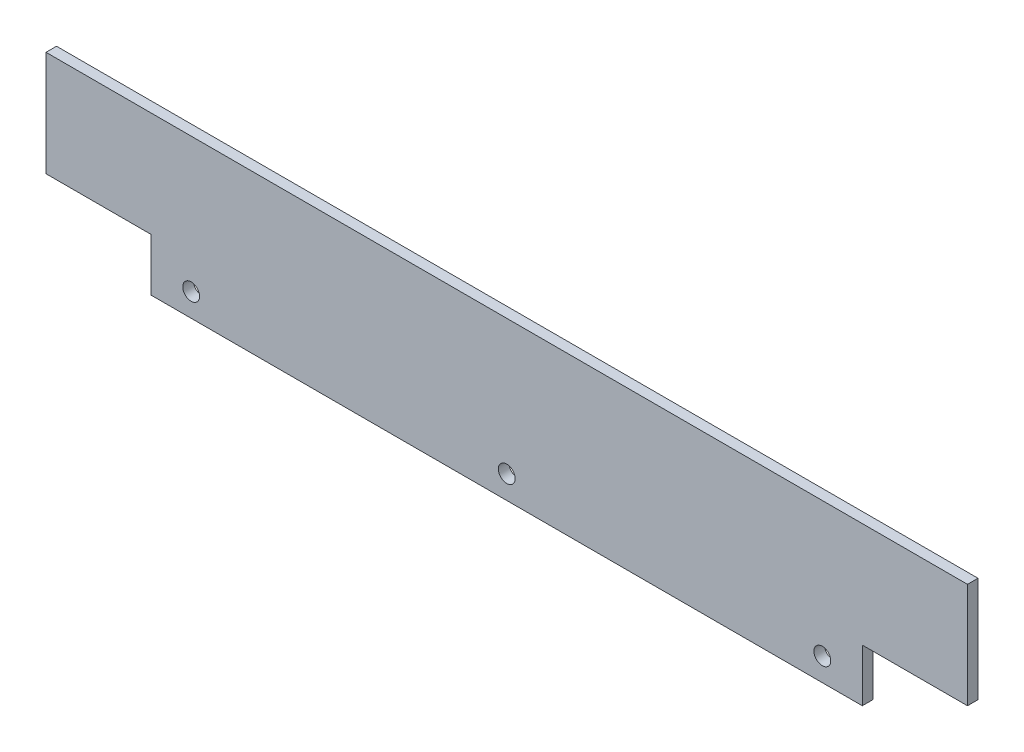
ISO-10303-21;
HEADER;
FILE_DESCRIPTION(('STEP AP214'),'2;1');
FILE_NAME('part.step','',(''),(''),'','','');
FILE_SCHEMA(('AUTOMOTIVE_DESIGN { 1 0 10303 214 1 1 1 1 }'));
ENDSEC;
DATA;
#1=APPLICATION_CONTEXT('core data for automotive mechanical design processes');
#2=APPLICATION_PROTOCOL_DEFINITION('international standard','automotive_design',2000,#1);
#3=PRODUCT_CONTEXT('',#1,'mechanical');
#4=PRODUCT('Part','Part','',(#3));
#5=PRODUCT_RELATED_PRODUCT_CATEGORY('part','',(#4));
#6=PRODUCT_DEFINITION_FORMATION('','',#4);
#7=PRODUCT_DEFINITION_CONTEXT('part definition',#1,'design');
#8=PRODUCT_DEFINITION('design','',#6,#7);
#9=PRODUCT_DEFINITION_SHAPE('','',#8);
#10=(LENGTH_UNIT() NAMED_UNIT(*) SI_UNIT(.MILLI.,.METRE.));
#11=(NAMED_UNIT(*) PLANE_ANGLE_UNIT() SI_UNIT($,.RADIAN.));
#12=(NAMED_UNIT(*) SI_UNIT($,.STERADIAN.) SOLID_ANGLE_UNIT());
#13=UNCERTAINTY_MEASURE_WITH_UNIT(LENGTH_MEASURE(1.E-05),#10,'distance_accuracy_value','');
#14=(GEOMETRIC_REPRESENTATION_CONTEXT(3) GLOBAL_UNCERTAINTY_ASSIGNED_CONTEXT((#13)) GLOBAL_UNIT_ASSIGNED_CONTEXT((#10,
#11,#12)) REPRESENTATION_CONTEXT('',''));
#15=CARTESIAN_POINT('',(0.,0.,0.));
#16=DIRECTION('',(0.,0.,1.));
#17=DIRECTION('',(1.,0.,0.));
#18=AXIS2_PLACEMENT_3D('',#15,#16,#17);
#19=CARTESIAN_POINT('',(0.,0.,4.99999999999995));
#20=DIRECTION('',(0.,0.,-1.));
#21=DIRECTION('',(-1.,0.,0.));
#22=AXIS2_PLACEMENT_3D('',#19,#20,#21);
#23=PLANE('',#22);
#24=DIRECTION('',(0.,1.,0.));
#25=VECTOR('',#24,1.);
#26=CARTESIAN_POINT('',(0.,25.,4.99999999999978));
#27=LINE('',#26,#25);
#28=CARTESIAN_POINT('',(0.,0.,4.99999999999995));
#29=VERTEX_POINT('',#28);
#30=CARTESIAN_POINT('',(0.,25.,4.99999999999978));
#31=VERTEX_POINT('',#30);
#32=EDGE_CURVE('E148',#29,#31,#27,.T.);
#33=ORIENTED_EDGE('',*,*,#32,.T.);
#34=DIRECTION('',(1.,0.,0.));
#35=VECTOR('',#34,1.);
#36=CARTESIAN_POINT('',(50.,25.,5.));
#37=LINE('',#36,#35);
#38=CARTESIAN_POINT('',(50.,25.,5.));
#39=VERTEX_POINT('',#38);
#40=EDGE_CURVE('E96',#31,#39,#37,.T.);
#41=ORIENTED_EDGE('',*,*,#40,.T.);
#42=DIRECTION('',(0.,1.,0.));
#43=VECTOR('',#42,1.);
#44=CARTESIAN_POINT('',(50.,75.,5.));
#45=LINE('',#44,#43);
#46=CARTESIAN_POINT('',(50.,75.,5.));
#47=VERTEX_POINT('',#46);
#48=EDGE_CURVE('E163',#39,#47,#45,.T.);
#49=ORIENTED_EDGE('',*,*,#48,.T.);
#50=DIRECTION('',(-1.,0.,0.));
#51=VECTOR('',#50,1.);
#52=CARTESIAN_POINT('',(-388.,75.,4.99999999999987));
#53=LINE('',#52,#51);
#54=CARTESIAN_POINT('',(-388.,75.,4.99999999999987));
#55=VERTEX_POINT('',#54);
#56=EDGE_CURVE('E176',#47,#55,#53,.T.);
#57=ORIENTED_EDGE('',*,*,#56,.T.);
#58=DIRECTION('',(0.,-1.,0.));
#59=VECTOR('',#58,1.);
#60=CARTESIAN_POINT('',(-388.,24.9999999999999,4.99999999999987));
#61=LINE('',#60,#59);
#62=CARTESIAN_POINT('',(-388.,24.9999999999999,4.99999999999987));
#63=VERTEX_POINT('',#62);
#64=EDGE_CURVE('E115',#55,#63,#61,.T.);
#65=ORIENTED_EDGE('',*,*,#64,.T.);
#66=DIRECTION('',(1.,0.,0.));
#67=VECTOR('',#66,1.);
#68=CARTESIAN_POINT('',(-338.,25.,4.9999999999997));
#69=LINE('',#68,#67);
#70=CARTESIAN_POINT('',(-338.,25.,4.9999999999997));
#71=VERTEX_POINT('',#70);
#72=EDGE_CURVE('E109',#63,#71,#69,.T.);
#73=ORIENTED_EDGE('',*,*,#72,.T.);
#74=DIRECTION('',(0.,-1.,0.));
#75=VECTOR('',#74,1.);
#76=CARTESIAN_POINT('',(-338.,0.,4.99999999999978));
#77=LINE('',#76,#75);
#78=CARTESIAN_POINT('',(-338.,0.,4.99999999999978));
#79=VERTEX_POINT('',#78);
#80=EDGE_CURVE('E113',#71,#79,#77,.T.);
#81=ORIENTED_EDGE('',*,*,#80,.T.);
#82=DIRECTION('',(1.,0.,0.));
#83=VECTOR('',#82,1.);
#84=CARTESIAN_POINT('',(0.,0.,4.99999999999995));
#85=LINE('',#84,#83);
#86=EDGE_CURVE('E53',#79,#29,#85,.T.);
#87=ORIENTED_EDGE('',*,*,#86,.T.);
#88=EDGE_LOOP('',(#33,#41,#49,#57,#65,#73,#81,#87));
#89=FACE_BOUND('',#88,.T.);
#90=CARTESIAN_POINT('',(-169.,11.,5.));
#91=DIRECTION('',(0.,0.,1.));
#92=DIRECTION('',(1.,0.,0.));
#93=AXIS2_PLACEMENT_3D('',#90,#91,#92);
#94=CIRCLE('',#93,3.99999999999999);
#95=CARTESIAN_POINT('',(-165.,11.,5.));
#96=VERTEX_POINT('',#95);
#97=EDGE_CURVE('E137',#96,#96,#94,.T.);
#98=ORIENTED_EDGE('',*,*,#97,.F.);
#99=EDGE_LOOP('',(#98));
#100=FACE_BOUND('',#99,.T.);
#101=CARTESIAN_POINT('',(-319.,11.,5.));
#102=DIRECTION('',(0.,0.,1.));
#103=DIRECTION('',(1.,0.,0.));
#104=AXIS2_PLACEMENT_3D('',#101,#102,#103);
#105=CIRCLE('',#104,3.99999999999999);
#106=CARTESIAN_POINT('',(-315.,11.,5.));
#107=VERTEX_POINT('',#106);
#108=EDGE_CURVE('E185',#107,#107,#105,.T.);
#109=ORIENTED_EDGE('',*,*,#108,.F.);
#110=EDGE_LOOP('',(#109));
#111=FACE_BOUND('',#110,.T.);
#112=CARTESIAN_POINT('',(-19.0000000000003,11.,5.));
#113=DIRECTION('',(0.,0.,1.));
#114=DIRECTION('',(1.,0.,0.));
#115=AXIS2_PLACEMENT_3D('',#112,#113,#114);
#116=CIRCLE('',#115,4.);
#117=CARTESIAN_POINT('',(-15.0000000000003,11.,5.));
#118=VERTEX_POINT('',#117);
#119=EDGE_CURVE('E191',#118,#118,#116,.T.);
#120=ORIENTED_EDGE('',*,*,#119,.F.);
#121=EDGE_LOOP('',(#120));
#122=FACE_BOUND('',#121,.T.);
#123=ADVANCED_FACE('F36',(#89,#100,#111,#122),#23,.F.);
#124=CARTESIAN_POINT('',(0.,0.,0.));
#125=DIRECTION('',(0.,0.,-1.));
#126=DIRECTION('',(-1.,0.,0.));
#127=AXIS2_PLACEMENT_3D('',#124,#125,#126);
#128=PLANE('',#127);
#129=CARTESIAN_POINT('',(-319.,11.,-1.11022302462516E-13));
#130=DIRECTION('',(0.,0.,1.));
#131=DIRECTION('',(1.,0.,0.));
#132=AXIS2_PLACEMENT_3D('',#129,#130,#131);
#133=CIRCLE('',#132,3.99999999999999);
#134=CARTESIAN_POINT('',(-315.,11.,-1.11022302462516E-13));
#135=VERTEX_POINT('',#134);
#136=EDGE_CURVE('E188',#135,#135,#133,.T.);
#137=ORIENTED_EDGE('',*,*,#136,.T.);
#138=EDGE_LOOP('',(#137));
#139=FACE_BOUND('',#138,.T.);
#140=DIRECTION('',(0.,1.,0.));
#141=VECTOR('',#140,1.);
#142=CARTESIAN_POINT('',(0.,25.,0.));
#143=LINE('',#142,#141);
#144=CARTESIAN_POINT('',(0.,0.,0.));
#145=VERTEX_POINT('',#144);
#146=CARTESIAN_POINT('',(0.,25.,0.));
#147=VERTEX_POINT('',#146);
#148=EDGE_CURVE('E133',#145,#147,#143,.T.);
#149=ORIENTED_EDGE('',*,*,#148,.F.);
#150=DIRECTION('',(1.,0.,0.));
#151=VECTOR('',#150,1.);
#152=CARTESIAN_POINT('',(0.,0.,0.));
#153=LINE('',#152,#151);
#154=CARTESIAN_POINT('',(-338.,0.,0.));
#155=VERTEX_POINT('',#154);
#156=EDGE_CURVE('E88',#155,#145,#153,.T.);
#157=ORIENTED_EDGE('',*,*,#156,.F.);
#158=DIRECTION('',(0.,-1.,0.));
#159=VECTOR('',#158,1.);
#160=CARTESIAN_POINT('',(-338.,0.,0.));
#161=LINE('',#160,#159);
#162=CARTESIAN_POINT('',(-338.,25.,0.));
#163=VERTEX_POINT('',#162);
#164=EDGE_CURVE('E82',#163,#155,#161,.T.);
#165=ORIENTED_EDGE('',*,*,#164,.F.);
#166=DIRECTION('',(1.,0.,0.));
#167=VECTOR('',#166,1.);
#168=CARTESIAN_POINT('',(-338.,25.,0.));
#169=LINE('',#168,#167);
#170=CARTESIAN_POINT('',(-388.,24.9999999999999,-1.94289029309402E-13));
#171=VERTEX_POINT('',#170);
#172=EDGE_CURVE('E123',#171,#163,#169,.T.);
#173=ORIENTED_EDGE('',*,*,#172,.F.);
#174=DIRECTION('',(0.,-1.,0.));
#175=VECTOR('',#174,1.);
#176=CARTESIAN_POINT('',(-388.,24.9999999999999,-1.94289029309402E-13));
#177=LINE('',#176,#175);
#178=CARTESIAN_POINT('',(-388.,75.,-1.94289029309402E-13));
#179=VERTEX_POINT('',#178);
#180=EDGE_CURVE('E143',#179,#171,#177,.T.);
#181=ORIENTED_EDGE('',*,*,#180,.F.);
#182=DIRECTION('',(-1.,0.,0.));
#183=VECTOR('',#182,1.);
#184=CARTESIAN_POINT('',(-388.,75.,-1.94289029309402E-13));
#185=LINE('',#184,#183);
#186=CARTESIAN_POINT('',(50.,75.,-1.11022302462516E-13));
#187=VERTEX_POINT('',#186);
#188=EDGE_CURVE('E141',#187,#179,#185,.T.);
#189=ORIENTED_EDGE('',*,*,#188,.F.);
#190=DIRECTION('',(0.,1.,0.));
#191=VECTOR('',#190,1.);
#192=CARTESIAN_POINT('',(50.,75.,-1.11022302462516E-13));
#193=LINE('',#192,#191);
#194=CARTESIAN_POINT('',(50.,25.,0.));
#195=VERTEX_POINT('',#194);
#196=EDGE_CURVE('E139',#195,#187,#193,.T.);
#197=ORIENTED_EDGE('',*,*,#196,.F.);
#198=DIRECTION('',(1.,0.,0.));
#199=VECTOR('',#198,1.);
#200=CARTESIAN_POINT('',(50.,25.,0.));
#201=LINE('',#200,#199);
#202=EDGE_CURVE('E136',#147,#195,#201,.T.);
#203=ORIENTED_EDGE('',*,*,#202,.F.);
#204=EDGE_LOOP('',(#149,#157,#165,#173,#181,#189,#197,#203));
#205=FACE_BOUND('',#204,.T.);
#206=CARTESIAN_POINT('',(-169.,11.,-1.11022302462516E-13));
#207=DIRECTION('',(0.,0.,1.));
#208=DIRECTION('',(1.,0.,0.));
#209=AXIS2_PLACEMENT_3D('',#206,#207,#208);
#210=CIRCLE('',#209,3.99999999999999);
#211=CARTESIAN_POINT('',(-165.,11.,-1.11022302462516E-13));
#212=VERTEX_POINT('',#211);
#213=EDGE_CURVE('E182',#212,#212,#210,.T.);
#214=ORIENTED_EDGE('',*,*,#213,.T.);
#215=EDGE_LOOP('',(#214));
#216=FACE_BOUND('',#215,.T.);
#217=CARTESIAN_POINT('',(-19.0000000000003,11.,-1.11022302462516E-13));
#218=DIRECTION('',(0.,0.,1.));
#219=DIRECTION('',(1.,0.,0.));
#220=AXIS2_PLACEMENT_3D('',#217,#218,#219);
#221=CIRCLE('',#220,4.);
#222=CARTESIAN_POINT('',(-15.0000000000003,11.,-1.11022302462516E-13));
#223=VERTEX_POINT('',#222);
#224=EDGE_CURVE('E194',#223,#223,#221,.T.);
#225=ORIENTED_EDGE('',*,*,#224,.T.);
#226=EDGE_LOOP('',(#225));
#227=FACE_BOUND('',#226,.T.);
#228=ADVANCED_FACE('F167',(#139,#205,#216,#227),#128,.T.);
#229=CARTESIAN_POINT('',(0.,25.,4.99999999999978));
#230=DIRECTION('',(-1.,0.,0.));
#231=DIRECTION('',(0.,-1.,0.));
#232=AXIS2_PLACEMENT_3D('',#229,#230,#231);
#233=PLANE('',#232);
#234=ORIENTED_EDGE('',*,*,#148,.T.);
#235=DIRECTION('',(0.,0.,-1.));
#236=VECTOR('',#235,1.);
#237=CARTESIAN_POINT('',(0.,25.,4.99999999999978));
#238=LINE('',#237,#236);
#239=EDGE_CURVE('E11',#31,#147,#238,.T.);
#240=ORIENTED_EDGE('',*,*,#239,.F.);
#241=ORIENTED_EDGE('',*,*,#32,.F.);
#242=DIRECTION('',(0.,0.,-1.));
#243=VECTOR('',#242,1.);
#244=CARTESIAN_POINT('',(0.,0.,4.99999999999995));
#245=LINE('',#244,#243);
#246=EDGE_CURVE('E129',#29,#145,#245,.T.);
#247=ORIENTED_EDGE('',*,*,#246,.T.);
#248=EDGE_LOOP('',(#234,#240,#241,#247));
#249=FACE_BOUND('',#248,.T.);
#250=ADVANCED_FACE('F38',(#249),#233,.F.);
#251=CARTESIAN_POINT('',(50.,25.,5.));
#252=DIRECTION('',(0.,1.,0.));
#253=DIRECTION('',(-1.,0.,0.));
#254=AXIS2_PLACEMENT_3D('',#251,#252,#253);
#255=PLANE('',#254);
#256=ORIENTED_EDGE('',*,*,#202,.T.);
#257=DIRECTION('',(0.,0.,-1.));
#258=VECTOR('',#257,1.);
#259=CARTESIAN_POINT('',(50.,25.,5.));
#260=LINE('',#259,#258);
#261=EDGE_CURVE('E45',#39,#195,#260,.T.);
#262=ORIENTED_EDGE('',*,*,#261,.F.);
#263=ORIENTED_EDGE('',*,*,#40,.F.);
#264=ORIENTED_EDGE('',*,*,#239,.T.);
#265=EDGE_LOOP('',(#256,#262,#263,#264));
#266=FACE_BOUND('',#265,.T.);
#267=ADVANCED_FACE('F226',(#266),#255,.F.);
#268=CARTESIAN_POINT('',(50.,75.,5.));
#269=DIRECTION('',(-1.,0.,0.));
#270=DIRECTION('',(0.,-1.,0.));
#271=AXIS2_PLACEMENT_3D('',#268,#269,#270);
#272=PLANE('',#271);
#273=ORIENTED_EDGE('',*,*,#196,.T.);
#274=DIRECTION('',(0.,0.,-1.));
#275=VECTOR('',#274,1.);
#276=CARTESIAN_POINT('',(50.,75.,5.));
#277=LINE('',#276,#275);
#278=EDGE_CURVE('E155',#47,#187,#277,.T.);
#279=ORIENTED_EDGE('',*,*,#278,.F.);
#280=ORIENTED_EDGE('',*,*,#48,.F.);
#281=ORIENTED_EDGE('',*,*,#261,.T.);
#282=EDGE_LOOP('',(#273,#279,#280,#281));
#283=FACE_BOUND('',#282,.T.);
#284=ADVANCED_FACE('F161',(#283),#272,.F.);
#285=CARTESIAN_POINT('',(-388.,75.,4.99999999999987));
#286=DIRECTION('',(0.,-1.,0.));
#287=DIRECTION('',(1.,0.,0.));
#288=AXIS2_PLACEMENT_3D('',#285,#286,#287);
#289=PLANE('',#288);
#290=ORIENTED_EDGE('',*,*,#188,.T.);
#291=DIRECTION('',(0.,0.,-1.));
#292=VECTOR('',#291,1.);
#293=CARTESIAN_POINT('',(-388.,75.,4.99999999999987));
#294=LINE('',#293,#292);
#295=EDGE_CURVE('E152',#55,#179,#294,.T.);
#296=ORIENTED_EDGE('',*,*,#295,.F.);
#297=ORIENTED_EDGE('',*,*,#56,.F.);
#298=ORIENTED_EDGE('',*,*,#278,.T.);
#299=EDGE_LOOP('',(#290,#296,#297,#298));
#300=FACE_BOUND('',#299,.T.);
#301=ADVANCED_FACE('F172',(#300),#289,.F.);
#302=CARTESIAN_POINT('',(-388.,24.9999999999999,4.99999999999987));
#303=DIRECTION('',(1.,0.,0.));
#304=DIRECTION('',(0.,0.,-1.));
#305=AXIS2_PLACEMENT_3D('',#302,#303,#304);
#306=PLANE('',#305);
#307=ORIENTED_EDGE('',*,*,#180,.T.);
#308=DIRECTION('',(0.,0.,-1.));
#309=VECTOR('',#308,1.);
#310=CARTESIAN_POINT('',(-388.,24.9999999999999,4.99999999999987));
#311=LINE('',#310,#309);
#312=EDGE_CURVE('E124',#63,#171,#311,.T.);
#313=ORIENTED_EDGE('',*,*,#312,.F.);
#314=ORIENTED_EDGE('',*,*,#64,.F.);
#315=ORIENTED_EDGE('',*,*,#295,.T.);
#316=EDGE_LOOP('',(#307,#313,#314,#315));
#317=FACE_BOUND('',#316,.T.);
#318=ADVANCED_FACE('F175',(#317),#306,.F.);
#319=CARTESIAN_POINT('',(-338.,25.,4.9999999999997));
#320=DIRECTION('',(0.,1.,0.));
#321=DIRECTION('',(-1.,0.,0.));
#322=AXIS2_PLACEMENT_3D('',#319,#320,#321);
#323=PLANE('',#322);
#324=ORIENTED_EDGE('',*,*,#172,.T.);
#325=DIRECTION('',(0.,0.,-1.));
#326=VECTOR('',#325,1.);
#327=CARTESIAN_POINT('',(-338.,25.,4.9999999999997));
#328=LINE('',#327,#326);
#329=EDGE_CURVE('E120',#71,#163,#328,.T.);
#330=ORIENTED_EDGE('',*,*,#329,.F.);
#331=ORIENTED_EDGE('',*,*,#72,.F.);
#332=ORIENTED_EDGE('',*,*,#312,.T.);
#333=EDGE_LOOP('',(#324,#330,#331,#332));
#334=FACE_BOUND('',#333,.T.);
#335=ADVANCED_FACE('F121',(#334),#323,.F.);
#336=CARTESIAN_POINT('',(-338.,0.,4.99999999999978));
#337=DIRECTION('',(1.,0.,0.));
#338=DIRECTION('',(0.,0.,-1.));
#339=AXIS2_PLACEMENT_3D('',#336,#337,#338);
#340=PLANE('',#339);
#341=ORIENTED_EDGE('',*,*,#164,.T.);
#342=DIRECTION('',(0.,0.,-1.));
#343=VECTOR('',#342,1.);
#344=CARTESIAN_POINT('',(-338.,0.,4.99999999999978));
#345=LINE('',#344,#343);
#346=EDGE_CURVE('E125',#79,#155,#345,.T.);
#347=ORIENTED_EDGE('',*,*,#346,.F.);
#348=ORIENTED_EDGE('',*,*,#80,.F.);
#349=ORIENTED_EDGE('',*,*,#329,.T.);
#350=EDGE_LOOP('',(#341,#347,#348,#349));
#351=FACE_BOUND('',#350,.T.);
#352=ADVANCED_FACE('F127',(#351),#340,.F.);
#353=CARTESIAN_POINT('',(0.,0.,4.99999999999995));
#354=DIRECTION('',(0.,1.,0.));
#355=DIRECTION('',(-1.,0.,0.));
#356=AXIS2_PLACEMENT_3D('',#353,#354,#355);
#357=PLANE('',#356);
#358=ORIENTED_EDGE('',*,*,#156,.T.);
#359=ORIENTED_EDGE('',*,*,#246,.F.);
#360=ORIENTED_EDGE('',*,*,#86,.F.);
#361=ORIENTED_EDGE('',*,*,#346,.T.);
#362=EDGE_LOOP('',(#358,#359,#360,#361));
#363=FACE_BOUND('',#362,.T.);
#364=ADVANCED_FACE('F214',(#363),#357,.F.);
#365=CARTESIAN_POINT('',(-169.,11.,5.));
#366=DIRECTION('',(0.,0.,-1.));
#367=DIRECTION('',(-1.,0.,0.));
#368=AXIS2_PLACEMENT_3D('',#365,#366,#367);
#369=CYLINDRICAL_SURFACE('',#368,3.99999999999999);
#370=ORIENTED_EDGE('',*,*,#97,.T.);
#371=EDGE_LOOP('',(#370));
#372=FACE_BOUND('',#371,.T.);
#373=ORIENTED_EDGE('',*,*,#213,.F.);
#374=EDGE_LOOP('',(#373));
#375=FACE_BOUND('',#374,.T.);
#376=ADVANCED_FACE('F211',(#372,#375),#369,.F.);
#377=CARTESIAN_POINT('',(-319.,11.,5.));
#378=DIRECTION('',(0.,0.,-1.));
#379=DIRECTION('',(-1.,0.,0.));
#380=AXIS2_PLACEMENT_3D('',#377,#378,#379);
#381=CYLINDRICAL_SURFACE('',#380,3.99999999999999);
#382=ORIENTED_EDGE('',*,*,#108,.T.);
#383=EDGE_LOOP('',(#382));
#384=FACE_BOUND('',#383,.T.);
#385=ORIENTED_EDGE('',*,*,#136,.F.);
#386=EDGE_LOOP('',(#385));
#387=FACE_BOUND('',#386,.T.);
#388=ADVANCED_FACE('F290',(#384,#387),#381,.F.);
#389=CARTESIAN_POINT('',(-19.0000000000003,11.,5.));
#390=DIRECTION('',(0.,0.,-1.));
#391=DIRECTION('',(-1.,0.,0.));
#392=AXIS2_PLACEMENT_3D('',#389,#390,#391);
#393=CYLINDRICAL_SURFACE('',#392,4.);
#394=ORIENTED_EDGE('',*,*,#119,.T.);
#395=EDGE_LOOP('',(#394));
#396=FACE_BOUND('',#395,.T.);
#397=ORIENTED_EDGE('',*,*,#224,.F.);
#398=EDGE_LOOP('',(#397));
#399=FACE_BOUND('',#398,.T.);
#400=ADVANCED_FACE('F200',(#396,#399),#393,.F.);
#401=CLOSED_SHELL('',(#123,#228,#250,#267,#284,#301,#318,#335,#352,#364,#376,#388,#400));
#402=MANIFOLD_SOLID_BREP('B2',#401);
#403=ADVANCED_BREP_SHAPE_REPRESENTATION('',(#18,#402),#14);
#404=SHAPE_DEFINITION_REPRESENTATION(#9,#403);
ENDSEC;
END-ISO-10303-21;
